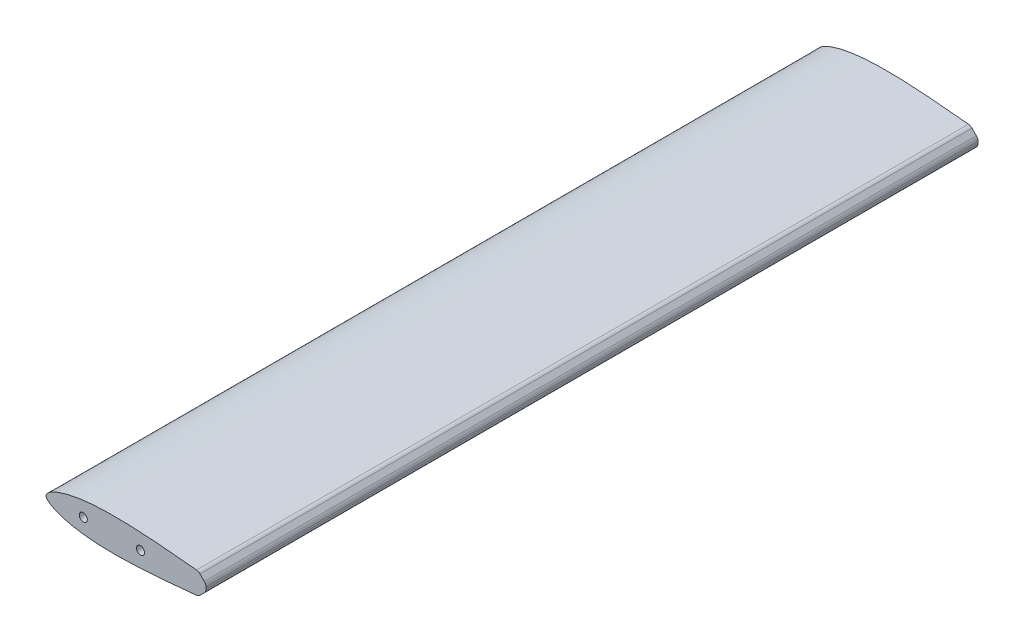
ISO-10303-21;
HEADER;
FILE_DESCRIPTION(('STEP AP214'),'2;1');
FILE_NAME('part.step','',(''),(''),'','','');
FILE_SCHEMA(('AUTOMOTIVE_DESIGN { 1 0 10303 214 1 1 1 1 }'));
ENDSEC;
DATA;
#1=APPLICATION_CONTEXT('core data for automotive mechanical design processes');
#2=APPLICATION_PROTOCOL_DEFINITION('international standard','automotive_design',2000,#1);
#3=PRODUCT_CONTEXT('',#1,'mechanical');
#4=PRODUCT('Part','Part','',(#3));
#5=PRODUCT_RELATED_PRODUCT_CATEGORY('part','',(#4));
#6=PRODUCT_DEFINITION_FORMATION('','',#4);
#7=PRODUCT_DEFINITION_CONTEXT('part definition',#1,'design');
#8=PRODUCT_DEFINITION('design','',#6,#7);
#9=PRODUCT_DEFINITION_SHAPE('','',#8);
#10=(LENGTH_UNIT() NAMED_UNIT(*) SI_UNIT(.MILLI.,.METRE.));
#11=(NAMED_UNIT(*) PLANE_ANGLE_UNIT() SI_UNIT($,.RADIAN.));
#12=(NAMED_UNIT(*) SI_UNIT($,.STERADIAN.) SOLID_ANGLE_UNIT());
#13=UNCERTAINTY_MEASURE_WITH_UNIT(LENGTH_MEASURE(1.E-05),#10,'distance_accuracy_value','');
#14=(GEOMETRIC_REPRESENTATION_CONTEXT(3) GLOBAL_UNCERTAINTY_ASSIGNED_CONTEXT((#13)) GLOBAL_UNIT_ASSIGNED_CONTEXT((#10,
#11,#12)) REPRESENTATION_CONTEXT('',''));
#15=CARTESIAN_POINT('',(0.,0.,0.));
#16=DIRECTION('',(0.,0.,1.));
#17=DIRECTION('',(1.,0.,0.));
#18=AXIS2_PLACEMENT_3D('',#15,#16,#17);
#19=CARTESIAN_POINT('',(234.188,0.,342.9));
#20=CARTESIAN_POINT('',(234.188,0.0155536867371754,342.9));
#21=CARTESIAN_POINT('',(232.462742238016,0.0763011183498608,342.9));
#22=CARTESIAN_POINT('',(230.745266477645,0.292527169730172,342.9));
#23=CARTESIAN_POINT('',(226.677132298683,0.685160998526905,342.9));
#24=CARTESIAN_POINT('',(221.753568546988,1.16400773563211,342.9));
#25=CARTESIAN_POINT('',(215.3729462007,1.68522549167521,342.9));
#26=CARTESIAN_POINT('',(207.860626626306,2.31925472415884,342.9));
#27=CARTESIAN_POINT('',(199.223228450697,3.07964727456537,342.9));
#28=CARTESIAN_POINT('',(189.624917000276,3.97906652208352,342.9));
#29=CARTESIAN_POINT('',(179.198535582012,5.00422639742074,342.9));
#30=CARTESIAN_POINT('',(168.099464270809,6.13682934498714,342.9));
#31=CARTESIAN_POINT('',(156.484959231023,7.35363328315477,342.9));
#32=CARTESIAN_POINT('',(144.512997428575,8.61174271170375,342.9));
#33=CARTESIAN_POINT('',(132.339974156296,9.87166744908778,342.9));
#34=CARTESIAN_POINT('',(120.116467894022,11.0852026217515,342.9));
#35=CARTESIAN_POINT('',(107.983552248755,12.1928122762789,342.9));
#36=CARTESIAN_POINT('',(96.0751169779638,13.1495005255012,342.9));
#37=CARTESIAN_POINT('',(84.511429242941,13.9022961995542,342.9));
#38=CARTESIAN_POINT('',(73.398930657052,14.404277626743,342.9));
#39=CARTESIAN_POINT('',(62.8303659193409,14.6175439004536,342.9));
#40=CARTESIAN_POINT('',(52.8907087007552,14.5288992131145,342.9));
#41=CARTESIAN_POINT('',(43.6527012524977,14.1187806479766,342.9));
#42=CARTESIAN_POINT('',(35.1768696170707,13.3806643516629,342.9));
#43=CARTESIAN_POINT('',(27.5098277844315,12.3176310606149,342.9));
#44=CARTESIAN_POINT('',(20.6924190451798,10.9652625561185,342.9));
#45=CARTESIAN_POINT('',(14.7650412799613,9.38991481063824,342.9));
#46=CARTESIAN_POINT('',(9.76935554134457,7.64375319719279,342.9));
#47=CARTESIAN_POINT('',(5.74944347020792,5.79620776104708,342.9));
#48=CARTESIAN_POINT('',(2.72813684802174,3.87076506472146,342.9));
#49=CARTESIAN_POINT('',(0.75513838257183,2.06686495836958,342.9));
#50=CARTESIAN_POINT('',(-0.307002000670747,0.,342.9));
#51=CARTESIAN_POINT('',(0.75513838257173,-2.06686495836939,342.9));
#52=CARTESIAN_POINT('',(2.72813684802176,-3.8707650647214,342.9));
#53=CARTESIAN_POINT('',(5.74944347020787,-5.7962077610469,342.9));
#54=CARTESIAN_POINT('',(9.76935554134459,-7.64375319719272,342.9));
#55=CARTESIAN_POINT('',(14.7650412799613,-9.38991481063812,342.9));
#56=CARTESIAN_POINT('',(20.6924190451799,-10.9652625561185,342.9));
#57=CARTESIAN_POINT('',(27.5098277844316,-12.3176310606148,342.9));
#58=CARTESIAN_POINT('',(35.1768696170708,-13.3806643516628,342.9));
#59=CARTESIAN_POINT('',(43.6527012524977,-14.1187806479765,342.9));
#60=CARTESIAN_POINT('',(52.8907087007555,-14.5288992131143,342.9));
#61=CARTESIAN_POINT('',(62.8303659193411,-14.6175439004534,342.9));
#62=CARTESIAN_POINT('',(73.3989306570518,-14.404277626743,342.9));
#63=CARTESIAN_POINT('',(84.511429242941,-13.902296199554,342.9));
#64=CARTESIAN_POINT('',(96.0751169779643,-13.1495005255013,342.9));
#65=CARTESIAN_POINT('',(107.983552248755,-12.1928122762789,342.9));
#66=CARTESIAN_POINT('',(120.116467894022,-11.0852026217515,342.9));
#67=CARTESIAN_POINT('',(132.339974156296,-9.87166744908783,342.9));
#68=CARTESIAN_POINT('',(144.512997428573,-8.61174271170374,342.9));
#69=CARTESIAN_POINT('',(156.484959231021,-7.35363328315465,342.9));
#70=CARTESIAN_POINT('',(168.099464270809,-6.13682934498709,342.9));
#71=CARTESIAN_POINT('',(179.198535582013,-5.00422639742061,342.9));
#72=CARTESIAN_POINT('',(189.624917000276,-3.97906652208336,342.9));
#73=CARTESIAN_POINT('',(199.223228450697,-3.07964727456527,342.9));
#74=CARTESIAN_POINT('',(207.860626626305,-2.31925472415887,342.9));
#75=CARTESIAN_POINT('',(215.372946200698,-1.68522549167517,342.9));
#76=CARTESIAN_POINT('',(221.753568546988,-1.16400773563204,342.9));
#77=CARTESIAN_POINT('',(226.677132298683,-0.685160998526885,342.9));
#78=CARTESIAN_POINT('',(230.745266477645,-0.292527169730231,342.9));
#79=CARTESIAN_POINT('',(232.462742238017,-0.0763011183498621,342.9));
#80=CARTESIAN_POINT('',(234.188,-0.0155536867371746,342.9));
#81=CARTESIAN_POINT('',(234.188,0.,342.9));
#82=B_SPLINE_CURVE_WITH_KNOTS('',3,(#19,#20,#21,#22,#23,#24,#25,#26,#27,#28,#29,#30,#31,#32,#33,
#34,#35,#36,#37,#38,#39,#40,#41,#42,#43,#44,#45,#46,#47,#48,#49,#50,#51,#52,#53,#54,#55,#56,#57,
#58,#59,#60,#61,#62,#63,#64,#65,#66,#67,#68,#69,#70,#71,#72,#73,#74,#75,#76,#77,#78,#79,#80,
#81),.UNSPECIFIED.,.T.,.F.,(4,1,1,1,1,1,1,1,1,1,1,1,1,1,1,1,1,1,1,1,1,1,1,1,1,1,1,1,1,1,1,1,1,1,
1,1,1,1,1,1,1,1,1,1,1,1,1,1,1,1,1,1,1,1,1,1,1,1,1,1,4),(0.,0.00172563476379416,
0.00673974483178372,0.0146959592279987,0.0253585857018278,0.0387010036513637,0.0546187297254756,
0.0728670420858862,0.0931742887105951,0.115236170244914,0.138726879481675,0.163314057854661,
0.188652327651034,0.214405506161386,0.24025088202969,0.265875120764067,0.29099755048633,
0.315354755940016,0.338722769262268,0.36092378194178,0.38180167100941,0.401202207986975,
0.419043051856454,0.435268910079612,0.449839477415212,0.462709567314331,0.473798585398369,
0.483060347557168,0.490497732750892,0.496136847068415,0.5,0.503863152931585,0.509502267249108,
0.516939652442832,0.526201414601631,0.537290432685669,0.550160522584788,0.564731089920388,
0.580956948143546,0.598797792013025,0.61819832899059,0.63907621805822,0.661277230737732,
0.684645244059984,0.70900244951367,0.734124879235933,0.75974911797031,0.785594493838614,
0.811347672348966,0.836685942145339,0.861273120518325,0.884763829755086,0.906825711289405,
0.927132957914114,0.945381270274525,0.961298996348636,0.974641414298172,0.985304040772001,
0.993260255168216,0.998274365236206,1.),.UNSPECIFIED.);
#83=DIRECTION('',(0.,0.,-1.));
#84=VECTOR('',#83,1.);
#85=SURFACE_OF_LINEAR_EXTRUSION('',#82,#84);
#86=CARTESIAN_POINT('',(133.704744308497,9.72436122011182,342.9));
#87=VERTEX_POINT('',#86);
#88=CARTESIAN_POINT('',(133.685563199419,-9.72631462722757,342.9));
#89=VERTEX_POINT('',#88);
#90=EDGE_CURVE('E164',#87,#89,#82,.T.);
#91=ORIENTED_EDGE('',*,*,#90,.F.);
#92=DIRECTION('',(0.,0.,-1.));
#93=VECTOR('',#92,1.);
#94=CARTESIAN_POINT('',(133.704744308497,9.72436122011182,342.9));
#95=LINE('',#94,#93);
#96=CARTESIAN_POINT('',(133.704744308497,9.72436122011182,-342.9));
#97=VERTEX_POINT('',#96);
#98=EDGE_CURVE('E111',#87,#97,#95,.T.);
#99=ORIENTED_EDGE('',*,*,#98,.T.);
#100=CARTESIAN_POINT('',(234.188,0.,-342.9));
#101=CARTESIAN_POINT('',(234.188,0.0155536867371754,-342.9));
#102=CARTESIAN_POINT('',(232.462742238016,0.0763011183498608,-342.9));
#103=CARTESIAN_POINT('',(230.745266477645,0.292527169730172,-342.9));
#104=CARTESIAN_POINT('',(226.677132298683,0.685160998526905,-342.9));
#105=CARTESIAN_POINT('',(221.753568546988,1.16400773563211,-342.9));
#106=CARTESIAN_POINT('',(215.3729462007,1.68522549167521,-342.9));
#107=CARTESIAN_POINT('',(207.860626626306,2.31925472415884,-342.9));
#108=CARTESIAN_POINT('',(199.223228450697,3.07964727456537,-342.9));
#109=CARTESIAN_POINT('',(189.624917000276,3.97906652208352,-342.9));
#110=CARTESIAN_POINT('',(179.198535582012,5.00422639742074,-342.9));
#111=CARTESIAN_POINT('',(168.099464270809,6.13682934498714,-342.9));
#112=CARTESIAN_POINT('',(156.484959231023,7.35363328315477,-342.9));
#113=CARTESIAN_POINT('',(144.512997428575,8.61174271170375,-342.9));
#114=CARTESIAN_POINT('',(132.339974156296,9.87166744908778,-342.9));
#115=CARTESIAN_POINT('',(120.116467894022,11.0852026217515,-342.9));
#116=CARTESIAN_POINT('',(107.983552248755,12.1928122762789,-342.9));
#117=CARTESIAN_POINT('',(96.0751169779638,13.1495005255012,-342.9));
#118=CARTESIAN_POINT('',(84.511429242941,13.9022961995542,-342.9));
#119=CARTESIAN_POINT('',(73.398930657052,14.404277626743,-342.9));
#120=CARTESIAN_POINT('',(62.8303659193409,14.6175439004536,-342.9));
#121=CARTESIAN_POINT('',(52.8907087007552,14.5288992131145,-342.9));
#122=CARTESIAN_POINT('',(43.6527012524977,14.1187806479766,-342.9));
#123=CARTESIAN_POINT('',(35.1768696170707,13.3806643516629,-342.9));
#124=CARTESIAN_POINT('',(27.5098277844315,12.3176310606149,-342.9));
#125=CARTESIAN_POINT('',(20.6924190451798,10.9652625561185,-342.9));
#126=CARTESIAN_POINT('',(14.7650412799613,9.38991481063824,-342.9));
#127=CARTESIAN_POINT('',(9.76935554134457,7.64375319719279,-342.9));
#128=CARTESIAN_POINT('',(5.74944347020792,5.79620776104708,-342.9));
#129=CARTESIAN_POINT('',(2.72813684802174,3.87076506472146,-342.9));
#130=CARTESIAN_POINT('',(0.75513838257183,2.06686495836958,-342.9));
#131=CARTESIAN_POINT('',(-0.307002000670747,0.,-342.9));
#132=CARTESIAN_POINT('',(0.75513838257173,-2.06686495836939,-342.9));
#133=CARTESIAN_POINT('',(2.72813684802176,-3.8707650647214,-342.9));
#134=CARTESIAN_POINT('',(5.74944347020787,-5.7962077610469,-342.9));
#135=CARTESIAN_POINT('',(9.76935554134459,-7.64375319719272,-342.9));
#136=CARTESIAN_POINT('',(14.7650412799613,-9.38991481063812,-342.9));
#137=CARTESIAN_POINT('',(20.6924190451799,-10.9652625561185,-342.9));
#138=CARTESIAN_POINT('',(27.5098277844316,-12.3176310606148,-342.9));
#139=CARTESIAN_POINT('',(35.1768696170708,-13.3806643516628,-342.9));
#140=CARTESIAN_POINT('',(43.6527012524977,-14.1187806479765,-342.9));
#141=CARTESIAN_POINT('',(52.8907087007555,-14.5288992131143,-342.9));
#142=CARTESIAN_POINT('',(62.8303659193411,-14.6175439004534,-342.9));
#143=CARTESIAN_POINT('',(73.3989306570518,-14.404277626743,-342.9));
#144=CARTESIAN_POINT('',(84.511429242941,-13.902296199554,-342.9));
#145=CARTESIAN_POINT('',(96.0751169779643,-13.1495005255013,-342.9));
#146=CARTESIAN_POINT('',(107.983552248755,-12.1928122762789,-342.9));
#147=CARTESIAN_POINT('',(120.116467894022,-11.0852026217515,-342.9));
#148=CARTESIAN_POINT('',(132.339974156296,-9.87166744908783,-342.9));
#149=CARTESIAN_POINT('',(144.512997428573,-8.61174271170374,-342.9));
#150=CARTESIAN_POINT('',(156.484959231021,-7.35363328315465,-342.9));
#151=CARTESIAN_POINT('',(168.099464270809,-6.13682934498709,-342.9));
#152=CARTESIAN_POINT('',(179.198535582013,-5.00422639742061,-342.9));
#153=CARTESIAN_POINT('',(189.624917000276,-3.97906652208336,-342.9));
#154=CARTESIAN_POINT('',(199.223228450697,-3.07964727456527,-342.9));
#155=CARTESIAN_POINT('',(207.860626626305,-2.31925472415887,-342.9));
#156=CARTESIAN_POINT('',(215.372946200698,-1.68522549167517,-342.9));
#157=CARTESIAN_POINT('',(221.753568546988,-1.16400773563204,-342.9));
#158=CARTESIAN_POINT('',(226.677132298683,-0.685160998526885,-342.9));
#159=CARTESIAN_POINT('',(230.745266477645,-0.292527169730231,-342.9));
#160=CARTESIAN_POINT('',(232.462742238017,-0.0763011183498621,-342.9));
#161=CARTESIAN_POINT('',(234.188,-0.0155536867371746,-342.9));
#162=CARTESIAN_POINT('',(234.188,0.,-342.9));
#163=B_SPLINE_CURVE_WITH_KNOTS('',3,(#100,#101,#102,#103,#104,#105,#106,#107,#108,#109,#110,
#111,#112,#113,#114,#115,#116,#117,#118,#119,#120,#121,#122,#123,#124,#125,#126,#127,#128,#129,
#130,#131,#132,#133,#134,#135,#136,#137,#138,#139,#140,#141,#142,#143,#144,#145,#146,#147,#148,
#149,#150,#151,#152,#153,#154,#155,#156,#157,#158,#159,#160,#161,#162),.UNSPECIFIED.,.T.,.F.,(4,
1,1,1,1,1,1,1,1,1,1,1,1,1,1,1,1,1,1,1,1,1,1,1,1,1,1,1,1,1,1,1,1,1,1,1,1,1,1,1,1,1,1,1,1,1,1,1,1,
1,1,1,1,1,1,1,1,1,1,1,4),(0.,0.00172563476379416,0.00673974483178372,0.0146959592279987,
0.0253585857018278,0.0387010036513637,0.0546187297254756,0.0728670420858862,0.0931742887105951,
0.115236170244914,0.138726879481675,0.163314057854661,0.188652327651034,0.214405506161386,
0.24025088202969,0.265875120764067,0.29099755048633,0.315354755940016,0.338722769262268,
0.36092378194178,0.38180167100941,0.401202207986975,0.419043051856454,0.435268910079612,
0.449839477415212,0.462709567314331,0.473798585398369,0.483060347557168,0.490497732750892,
0.496136847068415,0.5,0.503863152931585,0.509502267249108,0.516939652442832,0.526201414601631,
0.537290432685669,0.550160522584788,0.564731089920388,0.580956948143546,0.598797792013025,
0.61819832899059,0.63907621805822,0.661277230737732,0.684645244059984,0.70900244951367,
0.734124879235933,0.75974911797031,0.785594493838614,0.811347672348966,0.836685942145339,
0.861273120518325,0.884763829755086,0.906825711289405,0.927132957914114,0.945381270274525,
0.961298996348636,0.974641414298172,0.985304040772001,0.993260255168216,0.998274365236206,1.),.UNSPECIFIED.);
#164=CARTESIAN_POINT('',(133.685563199419,-9.72631462722757,-342.9));
#165=VERTEX_POINT('',#164);
#166=EDGE_CURVE('E156',#97,#165,#163,.T.);
#167=ORIENTED_EDGE('',*,*,#166,.T.);
#168=DIRECTION('',(0.,0.,-1.));
#169=VECTOR('',#168,1.);
#170=CARTESIAN_POINT('',(133.685563199419,-9.72631462722757,-342.9));
#171=LINE('',#170,#169);
#172=EDGE_CURVE('E117',#165,#89,#171,.F.);
#173=ORIENTED_EDGE('',*,*,#172,.T.);
#174=EDGE_LOOP('',(#91,#99,#167,#173));
#175=FACE_BOUND('',#174,.T.);
#176=ADVANCED_FACE('F39',(#175),#85,.F.);
#177=CARTESIAN_POINT('',(0.,0.,342.9));
#178=DIRECTION('',(0.,0.,-1.));
#179=DIRECTION('',(-1.,0.,0.));
#180=AXIS2_PLACEMENT_3D('',#177,#178,#179);
#181=PLANE('',#180);
#182=CARTESIAN_POINT('',(83.947,-0.0998191515342124,342.9));
#183=DIRECTION('',(0.,0.,-1.));
#184=DIRECTION('',(-1.,0.,0.));
#185=AXIS2_PLACEMENT_3D('',#182,#183,#184);
#186=CIRCLE('',#185,3.6);
#187=CARTESIAN_POINT('',(80.347,-0.0998191515342124,342.9));
#188=VERTEX_POINT('',#187);
#189=EDGE_CURVE('E152',#188,#188,#186,.F.);
#190=ORIENTED_EDGE('',*,*,#189,.F.);
#191=EDGE_LOOP('',(#190));
#192=FACE_BOUND('',#191,.T.);
#193=CARTESIAN_POINT('',(33.147,-0.0394142186844621,342.9));
#194=DIRECTION('',(0.,0.,-1.));
#195=DIRECTION('',(-1.,0.,0.));
#196=AXIS2_PLACEMENT_3D('',#193,#194,#195);
#197=CIRCLE('',#196,3.6);
#198=CARTESIAN_POINT('',(29.547,-0.0394142186844621,342.9));
#199=VERTEX_POINT('',#198);
#200=EDGE_CURVE('E151',#199,#199,#197,.F.);
#201=ORIENTED_EDGE('',*,*,#200,.F.);
#202=EDGE_LOOP('',(#201));
#203=FACE_BOUND('',#202,.T.);
#204=DIRECTION('',(0.70710678118654,-0.707106781186555,0.));
#205=VECTOR('',#204,1.);
#206=CARTESIAN_POINT('',(72.5223754825956,72.5223754825941,342.9));
#207=LINE('',#206,#205);
#208=CARTESIAN_POINT('',(136.782145486401,8.26260547878768,342.9));
#209=VERTEX_POINT('',#208);
#210=CARTESIAN_POINT('',(140.625102448428,4.41964851676077,342.9));
#211=VERTEX_POINT('',#210);
#212=EDGE_CURVE('E124',#209,#211,#207,.T.);
#213=ORIENTED_EDGE('',*,*,#212,.F.);
#214=CARTESIAN_POINT('',(133.190043037973,4.67050303036012,342.9));
#215=DIRECTION('',(0.,0.,-1.));
#216=DIRECTION('',(-1.,0.,0.));
#217=AXIS2_PLACEMENT_3D('',#214,#215,#216);
#218=CIRCLE('',#217,5.08);
#219=EDGE_CURVE('E106',#209,#87,#218,.F.);
#220=ORIENTED_EDGE('',*,*,#219,.T.);
#221=ORIENTED_EDGE('',*,*,#90,.T.);
#222=CARTESIAN_POINT('',(133.170892755939,-4.67245329804491,342.9));
#223=DIRECTION('',(0.,0.,-1.));
#224=DIRECTION('',(-1.,0.,0.));
#225=AXIS2_PLACEMENT_3D('',#222,#223,#224);
#226=CIRCLE('',#225,5.08);
#227=CARTESIAN_POINT('',(136.762995204367,-8.26455574647246,342.9));
#228=VERTEX_POINT('',#227);
#229=EDGE_CURVE('E129',#89,#228,#226,.F.);
#230=ORIENTED_EDGE('',*,*,#229,.T.);
#231=DIRECTION('',(0.707106781186527,0.707106781186568,0.));
#232=VECTOR('',#231,1.);
#233=CARTESIAN_POINT('',(72.5137754754236,-72.5137754754193,342.9));
#234=LINE('',#233,#232);
#235=CARTESIAN_POINT('',(140.625102448428,-4.40244850241134,342.9));
#236=VERTEX_POINT('',#235);
#237=EDGE_CURVE('E138',#228,#236,#234,.T.);
#238=ORIENTED_EDGE('',*,*,#237,.T.);
#239=CARTESIAN_POINT('',(137.033,-0.810346053983793,342.9));
#240=DIRECTION('',(0.,0.,-1.));
#241=DIRECTION('',(-1.,0.,0.));
#242=AXIS2_PLACEMENT_3D('',#239,#240,#241);
#243=CIRCLE('',#242,5.08);
#244=CARTESIAN_POINT('',(142.113,-0.810346053983753,342.9));
#245=VERTEX_POINT('',#244);
#246=EDGE_CURVE('E224',#236,#245,#243,.F.);
#247=ORIENTED_EDGE('',*,*,#246,.T.);
#248=DIRECTION('',(0.,1.,0.));
#249=VECTOR('',#248,1.);
#250=CARTESIAN_POINT('',(142.113,1.11318642939109E-12,342.9));
#251=LINE('',#250,#249);
#252=CARTESIAN_POINT('',(142.113,0.827546068333218,342.9));
#253=VERTEX_POINT('',#252);
#254=EDGE_CURVE('E135',#245,#253,#251,.T.);
#255=ORIENTED_EDGE('',*,*,#254,.T.);
#256=CARTESIAN_POINT('',(137.033,0.827546068333178,342.9));
#257=DIRECTION('',(0.,0.,-1.));
#258=DIRECTION('',(-1.,0.,0.));
#259=AXIS2_PLACEMENT_3D('',#256,#257,#258);
#260=CIRCLE('',#259,5.08);
#261=EDGE_CURVE('E118',#253,#211,#260,.F.);
#262=ORIENTED_EDGE('',*,*,#261,.T.);
#263=EDGE_LOOP('',(#213,#220,#221,#230,#238,#247,#255,#262));
#264=FACE_BOUND('',#263,.T.);
#265=ADVANCED_FACE('F132',(#192,#203,#264),#181,.F.);
#266=CARTESIAN_POINT('',(0.,0.,-342.9));
#267=DIRECTION('',(0.,0.,-1.));
#268=DIRECTION('',(-1.,0.,0.));
#269=AXIS2_PLACEMENT_3D('',#266,#267,#268);
#270=PLANE('',#269);
#271=CARTESIAN_POINT('',(33.147,-0.0394142186844621,-342.9));
#272=DIRECTION('',(0.,0.,-1.));
#273=DIRECTION('',(-1.,0.,0.));
#274=AXIS2_PLACEMENT_3D('',#271,#272,#273);
#275=CIRCLE('',#274,3.6);
#276=CARTESIAN_POINT('',(29.547,-0.0394142186844621,-342.9));
#277=VERTEX_POINT('',#276);
#278=EDGE_CURVE('E147',#277,#277,#275,.T.);
#279=ORIENTED_EDGE('',*,*,#278,.F.);
#280=EDGE_LOOP('',(#279));
#281=FACE_BOUND('',#280,.T.);
#282=CARTESIAN_POINT('',(83.947,-0.0998191515342124,-342.9));
#283=DIRECTION('',(0.,0.,-1.));
#284=DIRECTION('',(-1.,0.,0.));
#285=AXIS2_PLACEMENT_3D('',#282,#283,#284);
#286=CIRCLE('',#285,3.6);
#287=CARTESIAN_POINT('',(80.347,-0.0998191515342124,-342.9));
#288=VERTEX_POINT('',#287);
#289=EDGE_CURVE('E157',#288,#288,#286,.T.);
#290=ORIENTED_EDGE('',*,*,#289,.F.);
#291=EDGE_LOOP('',(#290));
#292=FACE_BOUND('',#291,.T.);
#293=ORIENTED_EDGE('',*,*,#166,.F.);
#294=CARTESIAN_POINT('',(133.190043037973,4.67050303036012,-342.9));
#295=DIRECTION('',(0.,0.,-1.));
#296=DIRECTION('',(-1.,0.,0.));
#297=AXIS2_PLACEMENT_3D('',#294,#295,#296);
#298=CIRCLE('',#297,5.08);
#299=CARTESIAN_POINT('',(136.782145486401,8.26260547878768,-342.9));
#300=VERTEX_POINT('',#299);
#301=EDGE_CURVE('E204',#97,#300,#298,.T.);
#302=ORIENTED_EDGE('',*,*,#301,.T.);
#303=DIRECTION('',(0.70710678118654,-0.707106781186555,0.));
#304=VECTOR('',#303,1.);
#305=CARTESIAN_POINT('',(72.5223754825956,72.5223754825941,-342.9));
#306=LINE('',#305,#304);
#307=CARTESIAN_POINT('',(140.625102448428,4.41964851676077,-342.9));
#308=VERTEX_POINT('',#307);
#309=EDGE_CURVE('E127',#300,#308,#306,.T.);
#310=ORIENTED_EDGE('',*,*,#309,.T.);
#311=CARTESIAN_POINT('',(137.033,0.827546068333178,-342.9));
#312=DIRECTION('',(0.,0.,-1.));
#313=DIRECTION('',(-1.,0.,0.));
#314=AXIS2_PLACEMENT_3D('',#311,#312,#313);
#315=CIRCLE('',#314,5.08);
#316=CARTESIAN_POINT('',(142.113,0.827546068333218,-342.9));
#317=VERTEX_POINT('',#316);
#318=EDGE_CURVE('E199',#308,#317,#315,.T.);
#319=ORIENTED_EDGE('',*,*,#318,.T.);
#320=DIRECTION('',(0.,1.,0.));
#321=VECTOR('',#320,1.);
#322=CARTESIAN_POINT('',(142.113,1.11318642939109E-12,-342.9));
#323=LINE('',#322,#321);
#324=CARTESIAN_POINT('',(142.113,-0.810346053983753,-342.9));
#325=VERTEX_POINT('',#324);
#326=EDGE_CURVE('E222',#325,#317,#323,.T.);
#327=ORIENTED_EDGE('',*,*,#326,.F.);
#328=CARTESIAN_POINT('',(137.033,-0.810346053983793,-342.9));
#329=DIRECTION('',(0.,0.,-1.));
#330=DIRECTION('',(-1.,0.,0.));
#331=AXIS2_PLACEMENT_3D('',#328,#329,#330);
#332=CIRCLE('',#331,5.08);
#333=CARTESIAN_POINT('',(140.625102448428,-4.40244850241134,-342.9));
#334=VERTEX_POINT('',#333);
#335=EDGE_CURVE('E55',#325,#334,#332,.T.);
#336=ORIENTED_EDGE('',*,*,#335,.T.);
#337=DIRECTION('',(0.707106781186527,0.707106781186568,0.));
#338=VECTOR('',#337,1.);
#339=CARTESIAN_POINT('',(72.5137754754236,-72.5137754754193,-342.9));
#340=LINE('',#339,#338);
#341=CARTESIAN_POINT('',(136.762995204367,-8.26455574647246,-342.9));
#342=VERTEX_POINT('',#341);
#343=EDGE_CURVE('E141',#342,#334,#340,.T.);
#344=ORIENTED_EDGE('',*,*,#343,.F.);
#345=CARTESIAN_POINT('',(133.170892755939,-4.67245329804491,-342.9));
#346=DIRECTION('',(0.,0.,-1.));
#347=DIRECTION('',(-1.,0.,0.));
#348=AXIS2_PLACEMENT_3D('',#345,#346,#347);
#349=CIRCLE('',#348,5.08);
#350=EDGE_CURVE('E200',#342,#165,#349,.T.);
#351=ORIENTED_EDGE('',*,*,#350,.T.);
#352=EDGE_LOOP('',(#293,#302,#310,#319,#327,#336,#344,#351));
#353=FACE_BOUND('',#352,.T.);
#354=ADVANCED_FACE('F181',(#281,#292,#353),#270,.T.);
#355=CARTESIAN_POINT('',(83.947,-0.0998191515342124,342.901));
#356=DIRECTION('',(0.,0.,-1.));
#357=DIRECTION('',(-1.,0.,0.));
#358=AXIS2_PLACEMENT_3D('',#355,#356,#357);
#359=CYLINDRICAL_SURFACE('',#358,3.6);
#360=ORIENTED_EDGE('',*,*,#289,.T.);
#361=EDGE_LOOP('',(#360));
#362=FACE_BOUND('',#361,.T.);
#363=ORIENTED_EDGE('',*,*,#189,.T.);
#364=EDGE_LOOP('',(#363));
#365=FACE_BOUND('',#364,.T.);
#366=ADVANCED_FACE('F254',(#362,#365),#359,.F.);
#367=CARTESIAN_POINT('',(33.147,-0.0394142186844621,342.901));
#368=DIRECTION('',(0.,0.,-1.));
#369=DIRECTION('',(-1.,0.,0.));
#370=AXIS2_PLACEMENT_3D('',#367,#368,#369);
#371=CYLINDRICAL_SURFACE('',#370,3.6);
#372=ORIENTED_EDGE('',*,*,#278,.T.);
#373=EDGE_LOOP('',(#372));
#374=FACE_BOUND('',#373,.T.);
#375=ORIENTED_EDGE('',*,*,#200,.T.);
#376=EDGE_LOOP('',(#375));
#377=FACE_BOUND('',#376,.T.);
#378=ADVANCED_FACE('F247',(#374,#377),#371,.F.);
#379=CARTESIAN_POINT('',(72.5137754754236,-72.5137754754193,-342.9));
#380=DIRECTION('',(0.707106781186568,-0.707106781186527,0.));
#381=DIRECTION('',(0.707106781186527,0.707106781186568,0.));
#382=AXIS2_PLACEMENT_3D('',#379,#380,#381);
#383=PLANE('',#382);
#384=ORIENTED_EDGE('',*,*,#343,.T.);
#385=DIRECTION('',(0.,0.,1.));
#386=VECTOR('',#385,1.);
#387=CARTESIAN_POINT('',(140.625102448428,-4.40244850241135,-342.9));
#388=LINE('',#387,#386);
#389=EDGE_CURVE('E11',#334,#236,#388,.T.);
#390=ORIENTED_EDGE('',*,*,#389,.T.);
#391=ORIENTED_EDGE('',*,*,#237,.F.);
#392=DIRECTION('',(0.,0.,1.));
#393=VECTOR('',#392,1.);
#394=CARTESIAN_POINT('',(136.762995204367,-8.26455574647247,-342.9));
#395=LINE('',#394,#393);
#396=EDGE_CURVE('E48',#228,#342,#395,.F.);
#397=ORIENTED_EDGE('',*,*,#396,.T.);
#398=EDGE_LOOP('',(#384,#390,#391,#397));
#399=FACE_BOUND('',#398,.T.);
#400=ADVANCED_FACE('F245',(#399),#383,.T.);
#401=CARTESIAN_POINT('',(142.113,1.11318642939109E-12,-342.9));
#402=DIRECTION('',(1.,0.,0.));
#403=DIRECTION('',(0.,1.,0.));
#404=AXIS2_PLACEMENT_3D('',#401,#402,#403);
#405=PLANE('',#404);
#406=ORIENTED_EDGE('',*,*,#326,.T.);
#407=DIRECTION('',(0.,0.,1.));
#408=VECTOR('',#407,1.);
#409=CARTESIAN_POINT('',(142.113,0.827546068333218,342.9));
#410=LINE('',#409,#408);
#411=EDGE_CURVE('E213',#317,#253,#410,.T.);
#412=ORIENTED_EDGE('',*,*,#411,.T.);
#413=ORIENTED_EDGE('',*,*,#254,.F.);
#414=DIRECTION('',(0.,0.,1.));
#415=VECTOR('',#414,1.);
#416=CARTESIAN_POINT('',(142.113,-0.810346053983753,-342.9));
#417=LINE('',#416,#415);
#418=EDGE_CURVE('E197',#245,#325,#417,.F.);
#419=ORIENTED_EDGE('',*,*,#418,.T.);
#420=EDGE_LOOP('',(#406,#412,#413,#419));
#421=FACE_BOUND('',#420,.T.);
#422=ADVANCED_FACE('F221',(#421),#405,.T.);
#423=CARTESIAN_POINT('',(72.5223754825956,72.5223754825941,-342.9));
#424=DIRECTION('',(-0.707106781186555,-0.70710678118654,0.));
#425=DIRECTION('',(0.70710678118654,-0.707106781186555,0.));
#426=AXIS2_PLACEMENT_3D('',#423,#424,#425);
#427=PLANE('',#426);
#428=ORIENTED_EDGE('',*,*,#309,.F.);
#429=DIRECTION('',(0.,0.,-1.));
#430=VECTOR('',#429,1.);
#431=CARTESIAN_POINT('',(136.782145486401,8.2626054787877,-342.9));
#432=LINE('',#431,#430);
#433=EDGE_CURVE('E110',#300,#209,#432,.F.);
#434=ORIENTED_EDGE('',*,*,#433,.T.);
#435=ORIENTED_EDGE('',*,*,#212,.T.);
#436=DIRECTION('',(0.,0.,1.));
#437=VECTOR('',#436,1.);
#438=CARTESIAN_POINT('',(140.625102448427,4.41964851676079,-342.9));
#439=LINE('',#438,#437);
#440=EDGE_CURVE('E130',#211,#308,#439,.F.);
#441=ORIENTED_EDGE('',*,*,#440,.T.);
#442=EDGE_LOOP('',(#428,#434,#435,#441));
#443=FACE_BOUND('',#442,.T.);
#444=ADVANCED_FACE('F123',(#443),#427,.F.);
#445=CARTESIAN_POINT('',(133.190043037973,4.67050303036012,0.));
#446=DIRECTION('',(0.,0.,-1.));
#447=DIRECTION('',(-1.,0.,0.));
#448=AXIS2_PLACEMENT_3D('',#445,#446,#447);
#449=CYLINDRICAL_SURFACE('',#448,5.08);
#450=ORIENTED_EDGE('',*,*,#301,.F.);
#451=ORIENTED_EDGE('',*,*,#98,.F.);
#452=ORIENTED_EDGE('',*,*,#219,.F.);
#453=ORIENTED_EDGE('',*,*,#433,.F.);
#454=EDGE_LOOP('',(#450,#451,#452,#453));
#455=FACE_BOUND('',#454,.T.);
#456=ADVANCED_FACE('F109',(#455),#449,.T.);
#457=CARTESIAN_POINT('',(137.033,0.827546068333178,-342.9));
#458=DIRECTION('',(0.,0.,-1.));
#459=DIRECTION('',(-1.,0.,0.));
#460=AXIS2_PLACEMENT_3D('',#457,#458,#459);
#461=CYLINDRICAL_SURFACE('',#460,5.08);
#462=ORIENTED_EDGE('',*,*,#318,.F.);
#463=ORIENTED_EDGE('',*,*,#440,.F.);
#464=ORIENTED_EDGE('',*,*,#261,.F.);
#465=ORIENTED_EDGE('',*,*,#411,.F.);
#466=EDGE_LOOP('',(#462,#463,#464,#465));
#467=FACE_BOUND('',#466,.T.);
#468=ADVANCED_FACE('F185',(#467),#461,.T.);
#469=CARTESIAN_POINT('',(137.033,-0.810346053983793,-342.9));
#470=DIRECTION('',(0.,0.,1.));
#471=DIRECTION('',(1.,0.,0.));
#472=AXIS2_PLACEMENT_3D('',#469,#470,#471);
#473=CYLINDRICAL_SURFACE('',#472,5.08);
#474=ORIENTED_EDGE('',*,*,#335,.F.);
#475=ORIENTED_EDGE('',*,*,#418,.F.);
#476=ORIENTED_EDGE('',*,*,#246,.F.);
#477=ORIENTED_EDGE('',*,*,#389,.F.);
#478=EDGE_LOOP('',(#474,#475,#476,#477));
#479=FACE_BOUND('',#478,.T.);
#480=ADVANCED_FACE('F187',(#479),#473,.T.);
#481=CARTESIAN_POINT('',(133.170892755939,-4.67245329804491,0.));
#482=DIRECTION('',(0.,0.,-1.));
#483=DIRECTION('',(-1.,0.,0.));
#484=AXIS2_PLACEMENT_3D('',#481,#482,#483);
#485=CYLINDRICAL_SURFACE('',#484,5.08);
#486=ORIENTED_EDGE('',*,*,#350,.F.);
#487=ORIENTED_EDGE('',*,*,#396,.F.);
#488=ORIENTED_EDGE('',*,*,#229,.F.);
#489=ORIENTED_EDGE('',*,*,#172,.F.);
#490=EDGE_LOOP('',(#486,#487,#488,#489));
#491=FACE_BOUND('',#490,.T.);
#492=ADVANCED_FACE('F41',(#491),#485,.T.);
#493=CLOSED_SHELL('',(#176,#265,#354,#366,#378,#400,#422,#444,#456,#468,#480,#492));
#494=MANIFOLD_SOLID_BREP('B2',#493);
#495=ADVANCED_BREP_SHAPE_REPRESENTATION('',(#18,#494),#14);
#496=SHAPE_DEFINITION_REPRESENTATION(#9,#495);
ENDSEC;
END-ISO-10303-21;
